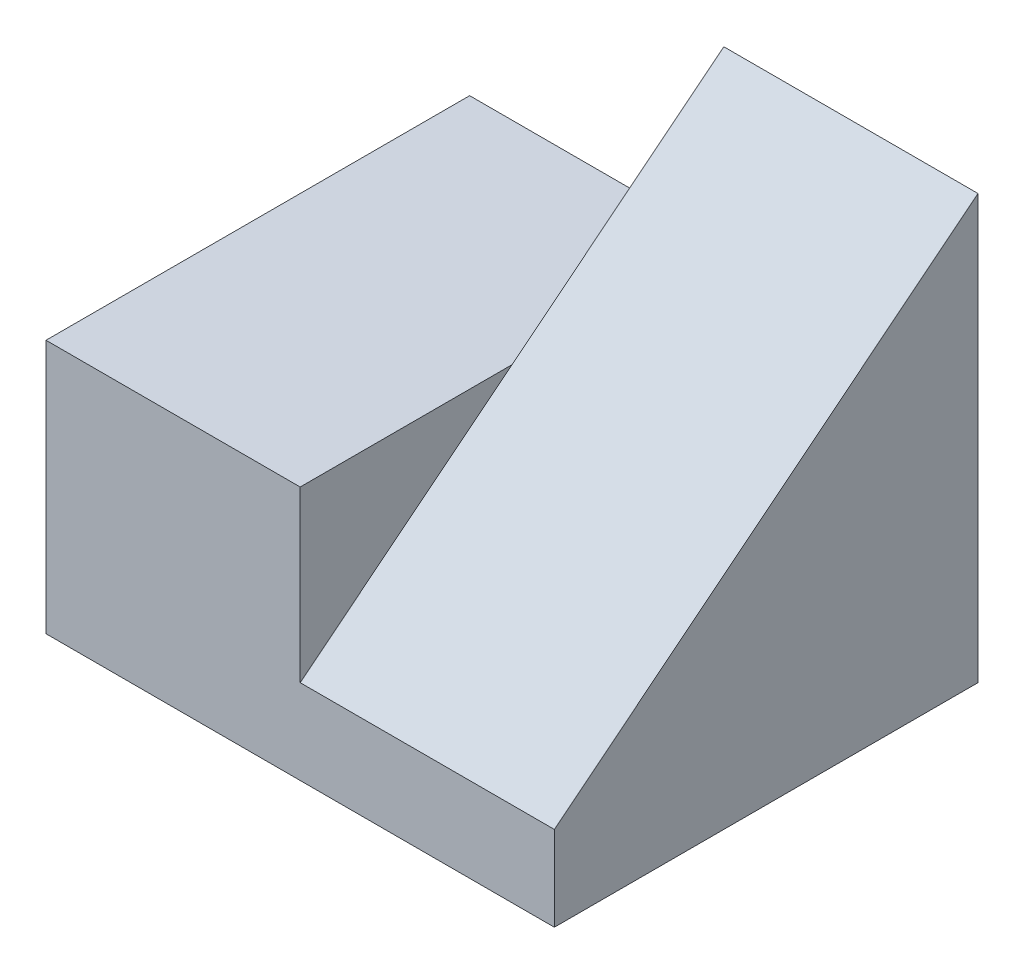
ISO-10303-21;
HEADER;
FILE_DESCRIPTION(('STEP AP214'),'2;1');
FILE_NAME('part.step','',(''),(''),'','','');
FILE_SCHEMA(('AUTOMOTIVE_DESIGN { 1 0 10303 214 1 1 1 1 }'));
ENDSEC;
DATA;
#1=APPLICATION_CONTEXT('core data for automotive mechanical design processes');
#2=APPLICATION_PROTOCOL_DEFINITION('international standard','automotive_design',2000,#1);
#3=PRODUCT_CONTEXT('',#1,'mechanical');
#4=PRODUCT('Part','Part','',(#3));
#5=PRODUCT_RELATED_PRODUCT_CATEGORY('part','',(#4));
#6=PRODUCT_DEFINITION_FORMATION('','',#4);
#7=PRODUCT_DEFINITION_CONTEXT('part definition',#1,'design');
#8=PRODUCT_DEFINITION('design','',#6,#7);
#9=PRODUCT_DEFINITION_SHAPE('','',#8);
#10=(LENGTH_UNIT() NAMED_UNIT(*) SI_UNIT(.MILLI.,.METRE.));
#11=(NAMED_UNIT(*) PLANE_ANGLE_UNIT() SI_UNIT($,.RADIAN.));
#12=(NAMED_UNIT(*) SI_UNIT($,.STERADIAN.) SOLID_ANGLE_UNIT());
#13=UNCERTAINTY_MEASURE_WITH_UNIT(LENGTH_MEASURE(1.E-05),#10,'distance_accuracy_value','');
#14=(GEOMETRIC_REPRESENTATION_CONTEXT(3) GLOBAL_UNCERTAINTY_ASSIGNED_CONTEXT((#13)) GLOBAL_UNIT_ASSIGNED_CONTEXT((#10,
#11,#12)) REPRESENTATION_CONTEXT('',''));
#15=CARTESIAN_POINT('',(0.,0.,0.));
#16=DIRECTION('',(0.,0.,1.));
#17=DIRECTION('',(1.,0.,0.));
#18=AXIS2_PLACEMENT_3D('',#15,#16,#17);
#19=CARTESIAN_POINT('',(15.,15.,25.));
#20=DIRECTION('',(-1.,0.,0.));
#21=DIRECTION('',(0.,0.,1.));
#22=AXIS2_PLACEMENT_3D('',#19,#20,#21);
#23=PLANE('',#22);
#24=DIRECTION('',(0.,-0.624695047554424,0.78086880944303));
#25=VECTOR('',#24,1.);
#26=CARTESIAN_POINT('',(15.,5.,25.));
#27=LINE('',#26,#25);
#28=CARTESIAN_POINT('',(15.,15.,12.5));
#29=VERTEX_POINT('',#28);
#30=CARTESIAN_POINT('',(15.,5.,25.));
#31=VERTEX_POINT('',#30);
#32=EDGE_CURVE('E48',#29,#31,#27,.T.);
#33=ORIENTED_EDGE('',*,*,#32,.F.);
#34=DIRECTION('',(0.,0.,-1.));
#35=VECTOR('',#34,1.);
#36=CARTESIAN_POINT('',(15.,15.,25.));
#37=LINE('',#36,#35);
#38=CARTESIAN_POINT('',(15.,15.,25.));
#39=VERTEX_POINT('',#38);
#40=EDGE_CURVE('E41',#39,#29,#37,.T.);
#41=ORIENTED_EDGE('',*,*,#40,.F.);
#42=DIRECTION('',(0.,1.,0.));
#43=VECTOR('',#42,1.);
#44=CARTESIAN_POINT('',(15.,15.,25.));
#45=LINE('',#44,#43);
#46=EDGE_CURVE('E91',#31,#39,#45,.T.);
#47=ORIENTED_EDGE('',*,*,#46,.F.);
#48=EDGE_LOOP('',(#33,#41,#47));
#49=FACE_BOUND('',#48,.T.);
#50=ADVANCED_FACE('F33',(#49),#23,.F.);
#51=CARTESIAN_POINT('',(30.,0.,25.));
#52=DIRECTION('',(0.,1.,0.));
#53=DIRECTION('',(0.,0.,1.));
#54=AXIS2_PLACEMENT_3D('',#51,#52,#53);
#55=PLANE('',#54);
#56=DIRECTION('',(1.,0.,0.));
#57=VECTOR('',#56,1.);
#58=CARTESIAN_POINT('',(30.,0.,0.));
#59=LINE('',#58,#57);
#60=CARTESIAN_POINT('',(0.,0.,0.));
#61=VERTEX_POINT('',#60);
#62=CARTESIAN_POINT('',(30.,0.,0.));
#63=VERTEX_POINT('',#62);
#64=EDGE_CURVE('E109',#61,#63,#59,.T.);
#65=ORIENTED_EDGE('',*,*,#64,.T.);
#66=DIRECTION('',(0.,0.,-1.));
#67=VECTOR('',#66,1.);
#68=CARTESIAN_POINT('',(30.,0.,25.));
#69=LINE('',#68,#67);
#70=CARTESIAN_POINT('',(30.,0.,25.));
#71=VERTEX_POINT('',#70);
#72=EDGE_CURVE('E11',#71,#63,#69,.T.);
#73=ORIENTED_EDGE('',*,*,#72,.F.);
#74=DIRECTION('',(1.,0.,0.));
#75=VECTOR('',#74,1.);
#76=CARTESIAN_POINT('',(30.,0.,25.));
#77=LINE('',#76,#75);
#78=CARTESIAN_POINT('',(0.,0.,25.));
#79=VERTEX_POINT('',#78);
#80=EDGE_CURVE('E119',#79,#71,#77,.T.);
#81=ORIENTED_EDGE('',*,*,#80,.F.);
#82=DIRECTION('',(0.,0.,-1.));
#83=VECTOR('',#82,1.);
#84=CARTESIAN_POINT('',(0.,0.,25.));
#85=LINE('',#84,#83);
#86=EDGE_CURVE('E105',#79,#61,#85,.T.);
#87=ORIENTED_EDGE('',*,*,#86,.T.);
#88=EDGE_LOOP('',(#65,#73,#81,#87));
#89=FACE_BOUND('',#88,.T.);
#90=ADVANCED_FACE('F35',(#89),#55,.F.);
#91=CARTESIAN_POINT('',(30.,5.,25.));
#92=DIRECTION('',(-1.,0.,0.));
#93=DIRECTION('',(0.,0.,1.));
#94=AXIS2_PLACEMENT_3D('',#91,#92,#93);
#95=PLANE('',#94);
#96=DIRECTION('',(0.,1.,0.));
#97=VECTOR('',#96,1.);
#98=CARTESIAN_POINT('',(30.,5.,0.));
#99=LINE('',#98,#97);
#100=CARTESIAN_POINT('',(30.,25.,0.));
#101=VERTEX_POINT('',#100);
#102=EDGE_CURVE('E112',#63,#101,#99,.T.);
#103=ORIENTED_EDGE('',*,*,#102,.T.);
#104=DIRECTION('',(0.,-0.624695047554424,0.78086880944303));
#105=VECTOR('',#104,1.);
#106=CARTESIAN_POINT('',(30.,5.,25.));
#107=LINE('',#106,#105);
#108=CARTESIAN_POINT('',(30.,5.,25.));
#109=VERTEX_POINT('',#108);
#110=EDGE_CURVE('E138',#101,#109,#107,.T.);
#111=ORIENTED_EDGE('',*,*,#110,.T.);
#112=DIRECTION('',(0.,1.,0.));
#113=VECTOR('',#112,1.);
#114=CARTESIAN_POINT('',(30.,5.,25.));
#115=LINE('',#114,#113);
#116=EDGE_CURVE('E83',#71,#109,#115,.T.);
#117=ORIENTED_EDGE('',*,*,#116,.F.);
#118=ORIENTED_EDGE('',*,*,#72,.T.);
#119=EDGE_LOOP('',(#103,#111,#117,#118));
#120=FACE_BOUND('',#119,.T.);
#121=ADVANCED_FACE('F145',(#120),#95,.F.);
#122=CARTESIAN_POINT('',(0.,15.,25.));
#123=DIRECTION('',(0.,-1.,0.));
#124=DIRECTION('',(0.,0.,-1.));
#125=AXIS2_PLACEMENT_3D('',#122,#123,#124);
#126=PLANE('',#125);
#127=DIRECTION('',(-1.,0.,0.));
#128=VECTOR('',#127,1.);
#129=CARTESIAN_POINT('',(0.,15.,0.));
#130=LINE('',#129,#128);
#131=CARTESIAN_POINT('',(15.,15.,0.));
#132=VERTEX_POINT('',#131);
#133=CARTESIAN_POINT('',(0.,15.,0.));
#134=VERTEX_POINT('',#133);
#135=EDGE_CURVE('E116',#132,#134,#130,.T.);
#136=ORIENTED_EDGE('',*,*,#135,.T.);
#137=DIRECTION('',(0.,0.,-1.));
#138=VECTOR('',#137,1.);
#139=CARTESIAN_POINT('',(0.,15.,25.));
#140=LINE('',#139,#138);
#141=CARTESIAN_POINT('',(0.,15.,25.));
#142=VERTEX_POINT('',#141);
#143=EDGE_CURVE('E102',#142,#134,#140,.T.);
#144=ORIENTED_EDGE('',*,*,#143,.F.);
#145=DIRECTION('',(-1.,0.,0.));
#146=VECTOR('',#145,1.);
#147=CARTESIAN_POINT('',(0.,15.,25.));
#148=LINE('',#147,#146);
#149=EDGE_CURVE('E94',#39,#142,#148,.T.);
#150=ORIENTED_EDGE('',*,*,#149,.F.);
#151=ORIENTED_EDGE('',*,*,#40,.T.);
#152=DIRECTION('',(0.,0.,1.));
#153=VECTOR('',#152,1.);
#154=CARTESIAN_POINT('',(15.,15.,25.));
#155=LINE('',#154,#153);
#156=EDGE_CURVE('E113',#132,#29,#155,.T.);
#157=ORIENTED_EDGE('',*,*,#156,.F.);
#158=EDGE_LOOP('',(#136,#144,#150,#151,#157));
#159=FACE_BOUND('',#158,.T.);
#160=ADVANCED_FACE('F103',(#159),#126,.F.);
#161=CARTESIAN_POINT('',(0.,0.,25.));
#162=DIRECTION('',(1.,0.,0.));
#163=DIRECTION('',(0.,0.,-1.));
#164=AXIS2_PLACEMENT_3D('',#161,#162,#163);
#165=PLANE('',#164);
#166=DIRECTION('',(0.,-1.,0.));
#167=VECTOR('',#166,1.);
#168=CARTESIAN_POINT('',(0.,0.,0.));
#169=LINE('',#168,#167);
#170=EDGE_CURVE('E75',#134,#61,#169,.T.);
#171=ORIENTED_EDGE('',*,*,#170,.T.);
#172=ORIENTED_EDGE('',*,*,#86,.F.);
#173=DIRECTION('',(0.,-1.,0.));
#174=VECTOR('',#173,1.);
#175=CARTESIAN_POINT('',(0.,0.,25.));
#176=LINE('',#175,#174);
#177=EDGE_CURVE('E57',#142,#79,#176,.T.);
#178=ORIENTED_EDGE('',*,*,#177,.F.);
#179=ORIENTED_EDGE('',*,*,#143,.T.);
#180=EDGE_LOOP('',(#171,#172,#178,#179));
#181=FACE_BOUND('',#180,.T.);
#182=ADVANCED_FACE('F121',(#181),#165,.F.);
#183=CARTESIAN_POINT('',(0.,0.,25.));
#184=DIRECTION('',(0.,0.,-1.));
#185=DIRECTION('',(-1.,0.,0.));
#186=AXIS2_PLACEMENT_3D('',#183,#184,#185);
#187=PLANE('',#186);
#188=ORIENTED_EDGE('',*,*,#80,.T.);
#189=ORIENTED_EDGE('',*,*,#116,.T.);
#190=DIRECTION('',(-1.,0.,0.));
#191=VECTOR('',#190,1.);
#192=CARTESIAN_POINT('',(15.,5.,25.));
#193=LINE('',#192,#191);
#194=EDGE_CURVE('E97',#109,#31,#193,.T.);
#195=ORIENTED_EDGE('',*,*,#194,.T.);
#196=ORIENTED_EDGE('',*,*,#46,.T.);
#197=ORIENTED_EDGE('',*,*,#149,.T.);
#198=ORIENTED_EDGE('',*,*,#177,.T.);
#199=EDGE_LOOP('',(#188,#189,#195,#196,#197,#198));
#200=FACE_BOUND('',#199,.T.);
#201=ADVANCED_FACE('F92',(#200),#187,.F.);
#202=CARTESIAN_POINT('',(0.,0.,0.));
#203=DIRECTION('',(0.,0.,-1.));
#204=DIRECTION('',(-1.,0.,0.));
#205=AXIS2_PLACEMENT_3D('',#202,#203,#204);
#206=PLANE('',#205);
#207=ORIENTED_EDGE('',*,*,#64,.F.);
#208=ORIENTED_EDGE('',*,*,#170,.F.);
#209=ORIENTED_EDGE('',*,*,#135,.F.);
#210=DIRECTION('',(0.,1.,0.));
#211=VECTOR('',#210,1.);
#212=CARTESIAN_POINT('',(15.,25.,0.));
#213=LINE('',#212,#211);
#214=CARTESIAN_POINT('',(15.,25.,0.));
#215=VERTEX_POINT('',#214);
#216=EDGE_CURVE('E142',#132,#215,#213,.T.);
#217=ORIENTED_EDGE('',*,*,#216,.T.);
#218=DIRECTION('',(-1.,0.,0.));
#219=VECTOR('',#218,1.);
#220=CARTESIAN_POINT('',(30.,25.,0.));
#221=LINE('',#220,#219);
#222=EDGE_CURVE('E135',#101,#215,#221,.T.);
#223=ORIENTED_EDGE('',*,*,#222,.F.);
#224=ORIENTED_EDGE('',*,*,#102,.F.);
#225=EDGE_LOOP('',(#207,#208,#209,#217,#223,#224));
#226=FACE_BOUND('',#225,.T.);
#227=ADVANCED_FACE('F125',(#226),#206,.T.);
#228=CARTESIAN_POINT('',(15.,0.,0.));
#229=DIRECTION('',(1.,0.,0.));
#230=DIRECTION('',(0.,0.,-1.));
#231=AXIS2_PLACEMENT_3D('',#228,#229,#230);
#232=PLANE('',#231);
#233=ORIENTED_EDGE('',*,*,#216,.F.);
#234=ORIENTED_EDGE('',*,*,#156,.T.);
#235=EDGE_CURVE('E139',#215,#29,#27,.T.);
#236=ORIENTED_EDGE('',*,*,#235,.F.);
#237=EDGE_LOOP('',(#233,#234,#236));
#238=FACE_BOUND('',#237,.T.);
#239=ADVANCED_FACE('F153',(#238),#232,.F.);
#240=CARTESIAN_POINT('',(30.,5.,25.));
#241=DIRECTION('',(0.,-0.78086880944303,-0.624695047554424));
#242=DIRECTION('',(0.,0.624695047554424,-0.78086880944303));
#243=AXIS2_PLACEMENT_3D('',#240,#241,#242);
#244=PLANE('',#243);
#245=ORIENTED_EDGE('',*,*,#235,.T.);
#246=ORIENTED_EDGE('',*,*,#32,.T.);
#247=ORIENTED_EDGE('',*,*,#194,.F.);
#248=ORIENTED_EDGE('',*,*,#110,.F.);
#249=ORIENTED_EDGE('',*,*,#222,.T.);
#250=EDGE_LOOP('',(#245,#246,#247,#248,#249));
#251=FACE_BOUND('',#250,.T.);
#252=ADVANCED_FACE('F148',(#251),#244,.F.);
#253=CLOSED_SHELL('',(#50,#90,#121,#160,#182,#201,#227,#239,#252));
#254=MANIFOLD_SOLID_BREP('B2',#253);
#255=ADVANCED_BREP_SHAPE_REPRESENTATION('',(#18,#254),#14);
#256=SHAPE_DEFINITION_REPRESENTATION(#9,#255);
ENDSEC;
END-ISO-10303-21;
